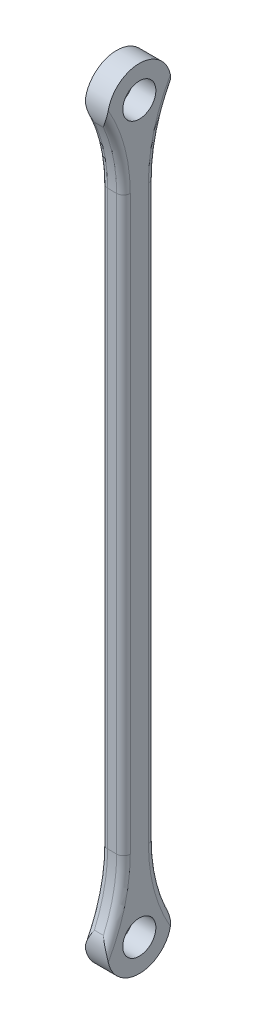
ISO-10303-21;
HEADER;
FILE_DESCRIPTION(('STEP AP214'),'2;1');
FILE_NAME('part.step','',(''),(''),'','','');
FILE_SCHEMA(('AUTOMOTIVE_DESIGN { 1 0 10303 214 1 1 1 1 }'));
ENDSEC;
DATA;
#1=APPLICATION_CONTEXT('core data for automotive mechanical design processes');
#2=APPLICATION_PROTOCOL_DEFINITION('international standard','automotive_design',2000,#1);
#3=PRODUCT_CONTEXT('',#1,'mechanical');
#4=PRODUCT('Part','Part','',(#3));
#5=PRODUCT_RELATED_PRODUCT_CATEGORY('part','',(#4));
#6=PRODUCT_DEFINITION_FORMATION('','',#4);
#7=PRODUCT_DEFINITION_CONTEXT('part definition',#1,'design');
#8=PRODUCT_DEFINITION('design','',#6,#7);
#9=PRODUCT_DEFINITION_SHAPE('','',#8);
#10=(LENGTH_UNIT() NAMED_UNIT(*) SI_UNIT(.MILLI.,.METRE.));
#11=(NAMED_UNIT(*) PLANE_ANGLE_UNIT() SI_UNIT($,.RADIAN.));
#12=(NAMED_UNIT(*) SI_UNIT($,.STERADIAN.) SOLID_ANGLE_UNIT());
#13=UNCERTAINTY_MEASURE_WITH_UNIT(LENGTH_MEASURE(1.E-05),#10,'distance_accuracy_value','');
#14=(GEOMETRIC_REPRESENTATION_CONTEXT(3) GLOBAL_UNCERTAINTY_ASSIGNED_CONTEXT((#13)) GLOBAL_UNIT_ASSIGNED_CONTEXT((#10,
#11,#12)) REPRESENTATION_CONTEXT('',''));
#15=CARTESIAN_POINT('',(0.,0.,0.));
#16=DIRECTION('',(0.,0.,1.));
#17=DIRECTION('',(1.,0.,0.));
#18=AXIS2_PLACEMENT_3D('',#15,#16,#17);
#19=CARTESIAN_POINT('',(-28.669607513477,31.0636668384129,65.25));
#20=DIRECTION('',(1.,0.,0.));
#21=DIRECTION('',(0.,0.,-1.));
#22=AXIS2_PLACEMENT_3D('',#19,#20,#21);
#23=CYLINDRICAL_SURFACE('',#22,7.);
#24=DIRECTION('',(1.,0.,0.));
#25=VECTOR('',#24,1.);
#26=CARTESIAN_POINT('',(-28.669607513477,33.8494969166002,71.6717716228053));
#27=LINE('',#26,#25);
#28=CARTESIAN_POINT('',(-27.169607513477,33.8494969166002,71.6717716228053));
#29=VERTEX_POINT('',#28);
#30=CARTESIAN_POINT('',(-25.169607513477,33.8494969166002,71.6717716228053));
#31=VERTEX_POINT('',#30);
#32=EDGE_CURVE('E318',#29,#31,#27,.T.);
#33=ORIENTED_EDGE('',*,*,#32,.F.);
#34=CARTESIAN_POINT('',(-28.669607513477,29.6404947748071,72.1038004988015));
#35=CARTESIAN_POINT('',(-28.6695704013757,29.7400734051743,72.1244921041939));
#36=CARTESIAN_POINT('',(-28.6650757040334,29.8399988829421,72.1429638390914));
#37=CARTESIAN_POINT('',(-28.6484590172141,30.0397461883465,72.1754422096041));
#38=CARTESIAN_POINT('',(-28.6363526543562,30.1395678096574,72.1894579048446));
#39=CARTESIAN_POINT('',(-28.6059186628535,30.3378836777137,72.2129839358825));
#40=CARTESIAN_POINT('',(-28.5876442962595,30.4363820228194,72.2225312268951));
#41=CARTESIAN_POINT('',(-28.5458275867531,30.632626970941,72.2374096350373));
#42=CARTESIAN_POINT('',(-28.5222816222107,30.730373009134,72.2427378421505));
#43=CARTESIAN_POINT('',(-28.4535825241448,30.9897693384142,72.2514900006123));
#44=CARTESIAN_POINT('',(-28.4044995805025,31.150511328527,72.2512670807801));
#45=CARTESIAN_POINT('',(-28.297203016173,31.4685213495004,72.2400956876657));
#46=CARTESIAN_POINT('',(-28.2389851473359,31.6257877250291,72.2291422117041));
#47=CARTESIAN_POINT('',(-28.1154897965387,31.937347335544,72.1970372703421));
#48=CARTESIAN_POINT('',(-28.0501785367024,32.0916218185841,72.1758351896584));
#49=CARTESIAN_POINT('',(-27.9146644049547,32.3962459172582,72.1237256351956));
#50=CARTESIAN_POINT('',(-27.8444629167562,32.5465966267232,72.0928208982182));
#51=CARTESIAN_POINT('',(-27.6770079861382,32.8923742076471,72.0099582888477));
#52=CARTESIAN_POINT('',(-27.5784661735063,33.086320347656,71.954418620875));
#53=CARTESIAN_POINT('',(-27.3787809153891,33.4669816952166,71.8275542861129));
#54=CARTESIAN_POINT('',(-27.277644068507,33.6537127016992,71.7562667094559));
#55=CARTESIAN_POINT('',(-27.1742139794816,33.8411541682721,71.6753859587341));
#56=CARTESIAN_POINT('',(-27.1719107354911,33.845326441299,71.6735808109836));
#57=CARTESIAN_POINT('',(-27.169607513477,33.8494969166002,71.6717716228053));
#58=B_SPLINE_CURVE_WITH_KNOTS('',3,(#34,#35,#36,#37,#38,#39,#40,#41,#42,#43,#44,#45,#46,#47,#48,
#49,#50,#51,#52,#53,#54,#55,#56,#57),.UNSPECIFIED.,.F.,.F.,(4,2,2,2,2,2,2,2,2,2,2,4),(0.,
0.304835484361001,0.609047181067465,0.910696435437838,1.21255356467109,1.71595938656179,
2.2196000124009,2.72575380788479,3.23176496202873,3.90459775131097,4.57586243902976,
4.59115105919159),.UNSPECIFIED.);
#59=CARTESIAN_POINT('',(-28.669607513477,29.6404947748071,72.1038004988015));
#60=VERTEX_POINT('',#59);
#61=EDGE_CURVE('E242',#29,#60,#58,.F.);
#62=ORIENTED_EDGE('',*,*,#61,.T.);
#63=CARTESIAN_POINT('',(-28.669607513477,31.0636668384129,65.25));
#64=DIRECTION('',(-1.,0.,0.));
#65=DIRECTION('',(0.,0.,1.));
#66=AXIS2_PLACEMENT_3D('',#63,#64,#65);
#67=CIRCLE('',#66,7.);
#68=CARTESIAN_POINT('',(-28.669607513477,29.6404947748071,58.3961995011985));
#69=VERTEX_POINT('',#68);
#70=EDGE_CURVE('E170',#69,#60,#67,.T.);
#71=ORIENTED_EDGE('',*,*,#70,.F.);
#72=CARTESIAN_POINT('',(-28.669607513477,29.6404947748071,58.3961995011985));
#73=CARTESIAN_POINT('',(-28.6695704013757,29.7400734051742,58.3755078958062));
#74=CARTESIAN_POINT('',(-28.6650757040334,29.839998882942,58.3570361609086));
#75=CARTESIAN_POINT('',(-28.6484590172142,30.0397461883463,58.324557790396));
#76=CARTESIAN_POINT('',(-28.6363526543562,30.1395678096571,58.3105420951554));
#77=CARTESIAN_POINT('',(-28.6059186628536,30.3378836777134,58.2870160641175));
#78=CARTESIAN_POINT('',(-28.5876442962596,30.4363820228192,58.2774687731049));
#79=CARTESIAN_POINT('',(-28.5458275867532,30.6326269709409,58.2625903649628));
#80=CARTESIAN_POINT('',(-28.5222816222107,30.730373009134,58.2572621578495));
#81=CARTESIAN_POINT('',(-28.4535825241448,30.9897693384143,58.2485099993877));
#82=CARTESIAN_POINT('',(-28.4044995805024,31.1505113285271,58.2487329192199));
#83=CARTESIAN_POINT('',(-28.297203016173,31.4685213495006,58.2599043123343));
#84=CARTESIAN_POINT('',(-28.2389851473358,31.6257877250293,58.2708577882959));
#85=CARTESIAN_POINT('',(-28.1154897965387,31.9373473355442,58.302962729658));
#86=CARTESIAN_POINT('',(-28.0501785367024,32.0916218185843,58.3241648103416));
#87=CARTESIAN_POINT('',(-27.9146644049546,32.3962459172582,58.3762743648044));
#88=CARTESIAN_POINT('',(-27.8444629167559,32.5465966267232,58.4071791017818));
#89=CARTESIAN_POINT('',(-27.6770079861386,32.8923742076473,58.4900417111524));
#90=CARTESIAN_POINT('',(-27.578466173508,33.0863203476568,58.5455813791254));
#91=CARTESIAN_POINT('',(-27.3787809153875,33.4669816952159,58.6724457138868));
#92=CARTESIAN_POINT('',(-27.2776440685008,33.6537127016964,58.7437332905428));
#93=CARTESIAN_POINT('',(-27.1742139794813,33.841154168272,58.8246140412659));
#94=CARTESIAN_POINT('',(-27.171910735491,33.845326441299,58.8264191890164));
#95=CARTESIAN_POINT('',(-27.169607513477,33.8494969166002,58.8282283771947));
#96=B_SPLINE_CURVE_WITH_KNOTS('',3,(#72,#73,#74,#75,#76,#77,#78,#79,#80,#81,#82,#83,#84,#85,#86,
#87,#88,#89,#90,#91,#92,#93,#94,#95),.UNSPECIFIED.,.F.,.F.,(4,2,2,2,2,2,2,2,2,2,2,4),(0.,
0.304835484360824,0.609047181067108,0.910696435437656,1.21255356467109,1.71595938656195,
2.21960001240117,2.72575380788493,3.23176496202877,3.90459775131097,4.57586243902978,
4.5911510591916),.UNSPECIFIED.);
#97=CARTESIAN_POINT('',(-27.169607513477,33.8494969166002,58.8282283771947));
#98=VERTEX_POINT('',#97);
#99=EDGE_CURVE('E159',#69,#98,#96,.T.);
#100=ORIENTED_EDGE('',*,*,#99,.T.);
#101=DIRECTION('',(1.,0.,0.));
#102=VECTOR('',#101,1.);
#103=CARTESIAN_POINT('',(-28.669607513477,33.8494969166002,58.8282283771947));
#104=LINE('',#103,#102);
#105=CARTESIAN_POINT('',(-25.169607513477,33.8494969166002,58.8282283771947));
#106=VERTEX_POINT('',#105);
#107=EDGE_CURVE('E155',#98,#106,#104,.T.);
#108=ORIENTED_EDGE('',*,*,#107,.T.);
#109=CARTESIAN_POINT('',(-23.669607513477,29.6404947748071,58.3961995011985));
#110=CARTESIAN_POINT('',(-23.6696446255784,29.7400734051742,58.3755078958062));
#111=CARTESIAN_POINT('',(-23.6741393229206,29.839998882942,58.3570361609086));
#112=CARTESIAN_POINT('',(-23.6907560097398,30.0397461883463,58.324557790396));
#113=CARTESIAN_POINT('',(-23.7028623725978,30.1395678096571,58.3105420951554));
#114=CARTESIAN_POINT('',(-23.7332963641004,30.3378836777134,58.2870160641175));
#115=CARTESIAN_POINT('',(-23.7515707306945,30.4363820228192,58.2774687731049));
#116=CARTESIAN_POINT('',(-23.7933874402009,30.6326269709409,58.2625903649628));
#117=CARTESIAN_POINT('',(-23.8169334047433,30.730373009134,58.2572621578495));
#118=CARTESIAN_POINT('',(-23.8856325028092,30.9897693384143,58.2485099993877));
#119=CARTESIAN_POINT('',(-23.9347154464516,31.1505113285271,58.2487329192199));
#120=CARTESIAN_POINT('',(-24.0420120107811,31.4685213495006,58.2599043123343));
#121=CARTESIAN_POINT('',(-24.1002298796182,31.6257877250293,58.2708577882959));
#122=CARTESIAN_POINT('',(-24.2237252304153,31.9373473355442,58.302962729658));
#123=CARTESIAN_POINT('',(-24.2890364902516,32.0916218185843,58.3241648103416));
#124=CARTESIAN_POINT('',(-24.4245506219995,32.3962459172582,58.3762743648044));
#125=CARTESIAN_POINT('',(-24.4947521101981,32.5465966267232,58.4071791017818));
#126=CARTESIAN_POINT('',(-24.6622070408154,32.8923742076473,58.4900417111524));
#127=CARTESIAN_POINT('',(-24.760748853446,33.0863203476568,58.5455813791254));
#128=CARTESIAN_POINT('',(-24.9604341115665,33.4669816952159,58.6724457138868));
#129=CARTESIAN_POINT('',(-25.0615709584532,33.6537127016964,58.7437332905428));
#130=CARTESIAN_POINT('',(-25.1650010474727,33.841154168272,58.8246140412659));
#131=CARTESIAN_POINT('',(-25.167304291463,33.845326441299,58.8264191890164));
#132=CARTESIAN_POINT('',(-25.169607513477,33.8494969166002,58.8282283771947));
#133=B_SPLINE_CURVE_WITH_KNOTS('',3,(#109,#110,#111,#112,#113,#114,#115,#116,#117,#118,#119,
#120,#121,#122,#123,#124,#125,#126,#127,#128,#129,#130,#131,#132),.UNSPECIFIED.,.F.,.F.,(4,2,2,
2,2,2,2,2,2,2,2,4),(0.,0.304835484360824,0.609047181067108,0.910696435437656,1.21255356467109,
1.71595938656195,2.21960001240117,2.72575380788493,3.23176496202877,3.90459775131097,
4.57586243902978,4.5911510591916),.UNSPECIFIED.);
#134=CARTESIAN_POINT('',(-23.669607513477,29.6404947748071,58.3961995011985));
#135=VERTEX_POINT('',#134);
#136=EDGE_CURVE('E149',#106,#135,#133,.F.);
#137=ORIENTED_EDGE('',*,*,#136,.T.);
#138=CARTESIAN_POINT('',(-23.669607513477,31.0636668384129,65.25));
#139=DIRECTION('',(-1.,0.,0.));
#140=DIRECTION('',(0.,0.,1.));
#141=AXIS2_PLACEMENT_3D('',#138,#139,#140);
#142=CIRCLE('',#141,7.);
#143=CARTESIAN_POINT('',(-23.669607513477,29.6404947748071,72.1038004988015));
#144=VERTEX_POINT('',#143);
#145=EDGE_CURVE('E152',#135,#144,#142,.T.);
#146=ORIENTED_EDGE('',*,*,#145,.T.);
#147=CARTESIAN_POINT('',(-23.669607513477,29.6404947748071,72.1038004988015));
#148=CARTESIAN_POINT('',(-23.6696446255783,29.7400734051743,72.1244921041939));
#149=CARTESIAN_POINT('',(-23.6741393229206,29.8399988829421,72.1429638390914));
#150=CARTESIAN_POINT('',(-23.6907560097399,30.0397461883465,72.1754422096041));
#151=CARTESIAN_POINT('',(-23.7028623725978,30.1395678096574,72.1894579048446));
#152=CARTESIAN_POINT('',(-23.7332963641005,30.3378836777137,72.2129839358825));
#153=CARTESIAN_POINT('',(-23.7515707306945,30.4363820228194,72.2225312268951));
#154=CARTESIAN_POINT('',(-23.7933874402009,30.632626970941,72.2374096350373));
#155=CARTESIAN_POINT('',(-23.8169334047433,30.730373009134,72.2427378421505));
#156=CARTESIAN_POINT('',(-23.8856325028092,30.9897693384142,72.2514900006123));
#157=CARTESIAN_POINT('',(-23.9347154464516,31.150511328527,72.2512670807801));
#158=CARTESIAN_POINT('',(-24.042012010781,31.4685213495004,72.2400956876657));
#159=CARTESIAN_POINT('',(-24.1002298796181,31.6257877250291,72.2291422117041));
#160=CARTESIAN_POINT('',(-24.2237252304153,31.937347335544,72.1970372703421));
#161=CARTESIAN_POINT('',(-24.2890364902517,32.0916218185841,72.1758351896584));
#162=CARTESIAN_POINT('',(-24.4245506219993,32.3962459172582,72.1237256351956));
#163=CARTESIAN_POINT('',(-24.4947521101978,32.5465966267232,72.0928208982182));
#164=CARTESIAN_POINT('',(-24.6622070408158,32.8923742076471,72.0099582888477));
#165=CARTESIAN_POINT('',(-24.7607488534477,33.086320347656,71.954418620875));
#166=CARTESIAN_POINT('',(-24.9604341115649,33.4669816952166,71.8275542861129));
#167=CARTESIAN_POINT('',(-25.061570958447,33.6537127016992,71.7562667094559));
#168=CARTESIAN_POINT('',(-25.1650010474724,33.8411541682721,71.6753859587341));
#169=CARTESIAN_POINT('',(-25.1673042914629,33.845326441299,71.6735808109836));
#170=CARTESIAN_POINT('',(-25.169607513477,33.8494969166002,71.6717716228053));
#171=B_SPLINE_CURVE_WITH_KNOTS('',3,(#147,#148,#149,#150,#151,#152,#153,#154,#155,#156,#157,
#158,#159,#160,#161,#162,#163,#164,#165,#166,#167,#168,#169,#170),.UNSPECIFIED.,.F.,.F.,(4,2,2,
2,2,2,2,2,2,2,2,4),(0.,0.304835484361001,0.609047181067465,0.910696435437838,1.21255356467109,
1.71595938656179,2.2196000124009,2.7257538078848,3.23176496202873,3.90459775131098,
4.57586243902976,4.59115105919159),.UNSPECIFIED.);
#172=EDGE_CURVE('E160',#144,#31,#171,.T.);
#173=ORIENTED_EDGE('',*,*,#172,.T.);
#174=EDGE_LOOP('',(#33,#62,#71,#100,#108,#137,#146,#173));
#175=FACE_BOUND('',#174,.T.);
#176=ADVANCED_FACE('F32',(#175),#23,.T.);
#177=CARTESIAN_POINT('',(-28.669607513477,31.0636668384129,65.25));
#178=DIRECTION('',(-1.,0.,0.));
#179=DIRECTION('',(0.,0.,1.));
#180=AXIS2_PLACEMENT_3D('',#177,#178,#179);
#181=PLANE('',#180);
#182=CARTESIAN_POINT('',(-28.669607513477,31.0636668384129,65.25));
#183=DIRECTION('',(-1.,0.,0.));
#184=DIRECTION('',(0.,0.,1.));
#185=AXIS2_PLACEMENT_3D('',#182,#183,#184);
#186=CIRCLE('',#185,3.65);
#187=CARTESIAN_POINT('',(-28.669607513477,31.0636668384129,68.9));
#188=VERTEX_POINT('',#187);
#189=EDGE_CURVE('E384',#188,#188,#186,.T.);
#190=ORIENTED_EDGE('',*,*,#189,.F.);
#191=EDGE_LOOP('',(#190));
#192=FACE_BOUND('',#191,.T.);
#193=CARTESIAN_POINT('',(-28.669607513477,191.063666838413,65.25));
#194=DIRECTION('',(-1.,0.,0.));
#195=DIRECTION('',(0.,0.,1.));
#196=AXIS2_PLACEMENT_3D('',#193,#194,#195);
#197=CIRCLE('',#196,3.65);
#198=CARTESIAN_POINT('',(-28.669607513477,191.063666838413,68.9));
#199=VERTEX_POINT('',#198);
#200=EDGE_CURVE('E381',#199,#199,#197,.T.);
#201=ORIENTED_EDGE('',*,*,#200,.F.);
#202=EDGE_LOOP('',(#201));
#203=FACE_BOUND('',#202,.T.);
#204=ORIENTED_EDGE('',*,*,#70,.T.);
#205=CARTESIAN_POINT('',(-28.669607513477,47.9262174468066,104.120801860091));
#206=DIRECTION('',(-1.,0.,0.));
#207=DIRECTION('',(0.,0.,1.));
#208=AXIS2_PLACEMENT_3D('',#205,#206,#207);
#209=CIRCLE('',#208,36.8708018600912);
#210=CARTESIAN_POINT('',(-28.669607513477,47.9262174468066,67.25));
#211=VERTEX_POINT('',#210);
#212=EDGE_CURVE('E201',#60,#211,#209,.F.);
#213=ORIENTED_EDGE('',*,*,#212,.T.);
#214=DIRECTION('',(0.,-1.,0.));
#215=VECTOR('',#214,1.);
#216=CARTESIAN_POINT('',(-28.669607513477,31.0636668384129,67.25));
#217=LINE('',#216,#215);
#218=CARTESIAN_POINT('',(-28.669607513477,174.201116230019,67.25));
#219=VERTEX_POINT('',#218);
#220=EDGE_CURVE('E199',#211,#219,#217,.F.);
#221=ORIENTED_EDGE('',*,*,#220,.T.);
#222=CARTESIAN_POINT('',(-28.669607513477,174.201116230019,104.120801860091));
#223=DIRECTION('',(-1.,0.,0.));
#224=DIRECTION('',(0.,0.,1.));
#225=AXIS2_PLACEMENT_3D('',#222,#223,#224);
#226=CIRCLE('',#225,36.8708018600912);
#227=CARTESIAN_POINT('',(-28.669607513477,192.486838902019,72.1038004988015));
#228=VERTEX_POINT('',#227);
#229=EDGE_CURVE('E197',#219,#228,#226,.F.);
#230=ORIENTED_EDGE('',*,*,#229,.T.);
#231=CARTESIAN_POINT('',(-28.669607513477,191.063666838413,65.25));
#232=DIRECTION('',(1.,0.,0.));
#233=DIRECTION('',(0.,0.,-1.));
#234=AXIS2_PLACEMENT_3D('',#231,#232,#233);
#235=CIRCLE('',#234,7.00000000000002);
#236=CARTESIAN_POINT('',(-28.669607513477,192.486838902019,58.3961995011985));
#237=VERTEX_POINT('',#236);
#238=EDGE_CURVE('E353',#237,#228,#235,.T.);
#239=ORIENTED_EDGE('',*,*,#238,.F.);
#240=CARTESIAN_POINT('',(-28.669607513477,174.201116230019,26.3791981399088));
#241=DIRECTION('',(-1.,0.,0.));
#242=DIRECTION('',(0.,0.,1.));
#243=AXIS2_PLACEMENT_3D('',#240,#241,#242);
#244=CIRCLE('',#243,36.8708018600912);
#245=CARTESIAN_POINT('',(-28.669607513477,174.201116230019,63.25));
#246=VERTEX_POINT('',#245);
#247=EDGE_CURVE('E191',#237,#246,#244,.F.);
#248=ORIENTED_EDGE('',*,*,#247,.T.);
#249=DIRECTION('',(0.,1.,0.));
#250=VECTOR('',#249,1.);
#251=CARTESIAN_POINT('',(-28.669607513477,31.0636668384129,63.25));
#252=LINE('',#251,#250);
#253=CARTESIAN_POINT('',(-28.669607513477,47.9262174468066,63.25));
#254=VERTEX_POINT('',#253);
#255=EDGE_CURVE('E193',#246,#254,#252,.F.);
#256=ORIENTED_EDGE('',*,*,#255,.T.);
#257=CARTESIAN_POINT('',(-28.669607513477,47.9262174468066,26.3791981399088));
#258=DIRECTION('',(-1.,0.,0.));
#259=DIRECTION('',(0.,0.,1.));
#260=AXIS2_PLACEMENT_3D('',#257,#258,#259);
#261=CIRCLE('',#260,36.8708018600912);
#262=EDGE_CURVE('E195',#254,#69,#261,.F.);
#263=ORIENTED_EDGE('',*,*,#262,.T.);
#264=EDGE_LOOP('',(#204,#213,#221,#230,#239,#248,#256,#263));
#265=FACE_BOUND('',#264,.T.);
#266=ADVANCED_FACE('F230',(#192,#203,#265),#181,.T.);
#267=CARTESIAN_POINT('',(-23.669607513477,31.0636668384129,65.25));
#268=DIRECTION('',(-1.,0.,0.));
#269=DIRECTION('',(0.,0.,1.));
#270=AXIS2_PLACEMENT_3D('',#267,#268,#269);
#271=PLANE('',#270);
#272=CARTESIAN_POINT('',(-23.669607513477,31.0636668384129,65.25));
#273=DIRECTION('',(-1.,0.,0.));
#274=DIRECTION('',(0.,0.,1.));
#275=AXIS2_PLACEMENT_3D('',#272,#273,#274);
#276=CIRCLE('',#275,3.65);
#277=CARTESIAN_POINT('',(-23.669607513477,31.0636668384129,68.9));
#278=VERTEX_POINT('',#277);
#279=EDGE_CURVE('E382',#278,#278,#276,.T.);
#280=ORIENTED_EDGE('',*,*,#279,.T.);
#281=EDGE_LOOP('',(#280));
#282=FACE_BOUND('',#281,.T.);
#283=CARTESIAN_POINT('',(-23.669607513477,191.063666838413,65.25));
#284=DIRECTION('',(-1.,0.,0.));
#285=DIRECTION('',(0.,0.,1.));
#286=AXIS2_PLACEMENT_3D('',#283,#284,#285);
#287=CIRCLE('',#286,3.65);
#288=CARTESIAN_POINT('',(-23.669607513477,191.063666838413,68.9));
#289=VERTEX_POINT('',#288);
#290=EDGE_CURVE('E354',#289,#289,#287,.T.);
#291=ORIENTED_EDGE('',*,*,#290,.T.);
#292=EDGE_LOOP('',(#291));
#293=FACE_BOUND('',#292,.T.);
#294=DIRECTION('',(0.,-1.,0.));
#295=VECTOR('',#294,1.);
#296=CARTESIAN_POINT('',(-23.669607513477,47.9262174468066,67.25));
#297=LINE('',#296,#295);
#298=CARTESIAN_POINT('',(-23.669607513477,174.201116230019,67.25));
#299=VERTEX_POINT('',#298);
#300=CARTESIAN_POINT('',(-23.669607513477,47.9262174468066,67.25));
#301=VERTEX_POINT('',#300);
#302=EDGE_CURVE('E178',#299,#301,#297,.T.);
#303=ORIENTED_EDGE('',*,*,#302,.T.);
#304=CARTESIAN_POINT('',(-23.669607513477,47.9262174468066,104.120801860091));
#305=DIRECTION('',(-1.,0.,0.));
#306=DIRECTION('',(0.,0.,1.));
#307=AXIS2_PLACEMENT_3D('',#304,#305,#306);
#308=CIRCLE('',#307,36.8708018600912);
#309=EDGE_CURVE('E169',#301,#144,#308,.T.);
#310=ORIENTED_EDGE('',*,*,#309,.T.);
#311=ORIENTED_EDGE('',*,*,#145,.F.);
#312=CARTESIAN_POINT('',(-23.669607513477,47.9262174468066,26.3791981399088));
#313=DIRECTION('',(-1.,0.,0.));
#314=DIRECTION('',(0.,0.,1.));
#315=AXIS2_PLACEMENT_3D('',#312,#313,#314);
#316=CIRCLE('',#315,36.8708018600912);
#317=CARTESIAN_POINT('',(-23.669607513477,47.9262174468066,63.25));
#318=VERTEX_POINT('',#317);
#319=EDGE_CURVE('E166',#135,#318,#316,.T.);
#320=ORIENTED_EDGE('',*,*,#319,.T.);
#321=DIRECTION('',(0.,1.,0.));
#322=VECTOR('',#321,1.);
#323=CARTESIAN_POINT('',(-23.669607513477,174.201116230019,63.25));
#324=LINE('',#323,#322);
#325=CARTESIAN_POINT('',(-23.669607513477,174.201116230019,63.25));
#326=VERTEX_POINT('',#325);
#327=EDGE_CURVE('E176',#318,#326,#324,.T.);
#328=ORIENTED_EDGE('',*,*,#327,.T.);
#329=CARTESIAN_POINT('',(-23.669607513477,174.201116230019,26.3791981399088));
#330=DIRECTION('',(-1.,0.,0.));
#331=DIRECTION('',(0.,0.,1.));
#332=AXIS2_PLACEMENT_3D('',#329,#330,#331);
#333=CIRCLE('',#332,36.8708018600912);
#334=CARTESIAN_POINT('',(-23.669607513477,192.486838902019,58.3961995011985));
#335=VERTEX_POINT('',#334);
#336=EDGE_CURVE('E180',#326,#335,#333,.T.);
#337=ORIENTED_EDGE('',*,*,#336,.T.);
#338=CARTESIAN_POINT('',(-23.669607513477,191.063666838413,65.25));
#339=DIRECTION('',(1.,0.,0.));
#340=DIRECTION('',(0.,0.,-1.));
#341=AXIS2_PLACEMENT_3D('',#338,#339,#340);
#342=CIRCLE('',#341,7.00000000000002);
#343=CARTESIAN_POINT('',(-23.669607513477,192.486838902019,72.1038004988015));
#344=VERTEX_POINT('',#343);
#345=EDGE_CURVE('E349',#335,#344,#342,.T.);
#346=ORIENTED_EDGE('',*,*,#345,.T.);
#347=CARTESIAN_POINT('',(-23.669607513477,174.201116230019,104.120801860091));
#348=DIRECTION('',(-1.,0.,0.));
#349=DIRECTION('',(0.,0.,1.));
#350=AXIS2_PLACEMENT_3D('',#347,#348,#349);
#351=CIRCLE('',#350,36.8708018600912);
#352=EDGE_CURVE('E175',#344,#299,#351,.T.);
#353=ORIENTED_EDGE('',*,*,#352,.T.);
#354=EDGE_LOOP('',(#303,#310,#311,#320,#328,#337,#346,#353));
#355=FACE_BOUND('',#354,.T.);
#356=ADVANCED_FACE('F164',(#282,#293,#355),#271,.F.);
#357=CARTESIAN_POINT('',(-28.669607513477,174.201116230019,26.3791981399088));
#358=DIRECTION('',(1.,0.,0.));
#359=DIRECTION('',(0.,0.,-1.));
#360=AXIS2_PLACEMENT_3D('',#357,#358,#359);
#361=CYLINDRICAL_SURFACE('',#360,35.3708018600912);
#362=DIRECTION('',(1.,0.,0.));
#363=VECTOR('',#362,1.);
#364=CARTESIAN_POINT('',(-28.669607513477,188.277836760226,58.8282283771947));
#365=LINE('',#364,#363);
#366=CARTESIAN_POINT('',(-27.169607513477,188.277836760226,58.8282283771947));
#367=VERTEX_POINT('',#366);
#368=CARTESIAN_POINT('',(-25.169607513477,188.277836760226,58.8282283771947));
#369=VERTEX_POINT('',#368);
#370=EDGE_CURVE('E358',#367,#369,#365,.T.);
#371=ORIENTED_EDGE('',*,*,#370,.T.);
#372=CARTESIAN_POINT('',(-25.169607513477,174.201116230019,26.3791981399088));
#373=DIRECTION('',(-1.,0.,0.));
#374=DIRECTION('',(0.,0.,1.));
#375=AXIS2_PLACEMENT_3D('',#372,#373,#374);
#376=CIRCLE('',#375,35.3708018600912);
#377=CARTESIAN_POINT('',(-25.169607513477,174.201116230019,61.75));
#378=VERTEX_POINT('',#377);
#379=EDGE_CURVE('E11',#369,#378,#376,.F.);
#380=ORIENTED_EDGE('',*,*,#379,.T.);
#381=DIRECTION('',(1.,0.,0.));
#382=VECTOR('',#381,1.);
#383=CARTESIAN_POINT('',(-28.669607513477,174.201116230019,61.75));
#384=LINE('',#383,#382);
#385=CARTESIAN_POINT('',(-27.169607513477,174.201116230019,61.75));
#386=VERTEX_POINT('',#385);
#387=EDGE_CURVE('E171',#386,#378,#384,.T.);
#388=ORIENTED_EDGE('',*,*,#387,.F.);
#389=CARTESIAN_POINT('',(-27.169607513477,174.201116230019,26.3791981399088));
#390=DIRECTION('',(-1.,0.,0.));
#391=DIRECTION('',(0.,0.,1.));
#392=AXIS2_PLACEMENT_3D('',#389,#390,#391);
#393=CIRCLE('',#392,35.3708018600912);
#394=EDGE_CURVE('E42',#386,#367,#393,.T.);
#395=ORIENTED_EDGE('',*,*,#394,.T.);
#396=EDGE_LOOP('',(#371,#380,#388,#395));
#397=FACE_BOUND('',#396,.T.);
#398=ADVANCED_FACE('F295',(#397),#361,.F.);
#399=CARTESIAN_POINT('',(-28.669607513477,174.201116230019,61.75));
#400=DIRECTION('',(0.,0.,-1.));
#401=DIRECTION('',(-1.,0.,0.));
#402=AXIS2_PLACEMENT_3D('',#399,#400,#401);
#403=PLANE('',#402);
#404=DIRECTION('',(1.,0.,0.));
#405=VECTOR('',#404,1.);
#406=CARTESIAN_POINT('',(-28.669607513477,47.9262174468066,61.75));
#407=LINE('',#406,#405);
#408=CARTESIAN_POINT('',(-27.169607513477,47.9262174468066,61.75));
#409=VERTEX_POINT('',#408);
#410=CARTESIAN_POINT('',(-25.169607513477,47.9262174468066,61.75));
#411=VERTEX_POINT('',#410);
#412=EDGE_CURVE('E363',#409,#411,#407,.T.);
#413=ORIENTED_EDGE('',*,*,#412,.F.);
#414=DIRECTION('',(0.,1.,0.));
#415=VECTOR('',#414,1.);
#416=CARTESIAN_POINT('',(-27.169607513477,174.201116230019,61.75));
#417=LINE('',#416,#415);
#418=EDGE_CURVE('E205',#409,#386,#417,.T.);
#419=ORIENTED_EDGE('',*,*,#418,.T.);
#420=ORIENTED_EDGE('',*,*,#387,.T.);
#421=DIRECTION('',(0.,1.,0.));
#422=VECTOR('',#421,1.);
#423=CARTESIAN_POINT('',(-25.169607513477,47.9262174468066,61.75));
#424=LINE('',#423,#422);
#425=EDGE_CURVE('E203',#378,#411,#424,.F.);
#426=ORIENTED_EDGE('',*,*,#425,.T.);
#427=EDGE_LOOP('',(#413,#419,#420,#426));
#428=FACE_BOUND('',#427,.T.);
#429=ADVANCED_FACE('F361',(#428),#403,.T.);
#430=CARTESIAN_POINT('',(-28.669607513477,47.9262174468066,26.3791981399088));
#431=DIRECTION('',(1.,0.,0.));
#432=DIRECTION('',(0.,0.,-1.));
#433=AXIS2_PLACEMENT_3D('',#430,#431,#432);
#434=CYLINDRICAL_SURFACE('',#433,35.3708018600912);
#435=ORIENTED_EDGE('',*,*,#107,.F.);
#436=CARTESIAN_POINT('',(-27.169607513477,47.9262174468066,26.3791981399088));
#437=DIRECTION('',(-1.,0.,0.));
#438=DIRECTION('',(0.,0.,1.));
#439=AXIS2_PLACEMENT_3D('',#436,#437,#438);
#440=CIRCLE('',#439,35.3708018600912);
#441=EDGE_CURVE('E309',#98,#409,#440,.T.);
#442=ORIENTED_EDGE('',*,*,#441,.T.);
#443=ORIENTED_EDGE('',*,*,#412,.T.);
#444=CARTESIAN_POINT('',(-25.169607513477,47.9262174468066,26.3791981399088));
#445=DIRECTION('',(-1.,0.,0.));
#446=DIRECTION('',(0.,0.,1.));
#447=AXIS2_PLACEMENT_3D('',#444,#445,#446);
#448=CIRCLE('',#447,35.3708018600912);
#449=EDGE_CURVE('E310',#411,#106,#448,.F.);
#450=ORIENTED_EDGE('',*,*,#449,.T.);
#451=EDGE_LOOP('',(#435,#442,#443,#450));
#452=FACE_BOUND('',#451,.T.);
#453=ADVANCED_FACE('F446',(#452),#434,.F.);
#454=CARTESIAN_POINT('',(-28.669607513477,47.9262174468066,104.120801860091));
#455=DIRECTION('',(1.,0.,0.));
#456=DIRECTION('',(0.,0.,-1.));
#457=AXIS2_PLACEMENT_3D('',#454,#455,#456);
#458=CYLINDRICAL_SURFACE('',#457,35.3708018600912);
#459=DIRECTION('',(1.,0.,0.));
#460=VECTOR('',#459,1.);
#461=CARTESIAN_POINT('',(-28.669607513477,47.9262174468066,68.75));
#462=LINE('',#461,#460);
#463=CARTESIAN_POINT('',(-27.169607513477,47.9262174468066,68.75));
#464=VERTEX_POINT('',#463);
#465=CARTESIAN_POINT('',(-25.169607513477,47.9262174468066,68.75));
#466=VERTEX_POINT('',#465);
#467=EDGE_CURVE('E370',#464,#466,#462,.T.);
#468=ORIENTED_EDGE('',*,*,#467,.F.);
#469=CARTESIAN_POINT('',(-27.169607513477,47.9262174468066,104.120801860091));
#470=DIRECTION('',(-1.,0.,0.));
#471=DIRECTION('',(0.,0.,1.));
#472=AXIS2_PLACEMENT_3D('',#469,#470,#471);
#473=CIRCLE('',#472,35.3708018600912);
#474=EDGE_CURVE('E210',#464,#29,#473,.T.);
#475=ORIENTED_EDGE('',*,*,#474,.T.);
#476=ORIENTED_EDGE('',*,*,#32,.T.);
#477=CARTESIAN_POINT('',(-25.169607513477,47.9262174468066,104.120801860091));
#478=DIRECTION('',(-1.,0.,0.));
#479=DIRECTION('',(0.,0.,1.));
#480=AXIS2_PLACEMENT_3D('',#477,#478,#479);
#481=CIRCLE('',#480,35.3708018600912);
#482=EDGE_CURVE('E208',#31,#466,#481,.F.);
#483=ORIENTED_EDGE('',*,*,#482,.T.);
#484=EDGE_LOOP('',(#468,#475,#476,#483));
#485=FACE_BOUND('',#484,.T.);
#486=ADVANCED_FACE('F448',(#485),#458,.F.);
#487=CARTESIAN_POINT('',(-28.669607513477,174.201116230019,68.75));
#488=DIRECTION('',(0.,0.,1.));
#489=DIRECTION('',(1.,0.,0.));
#490=AXIS2_PLACEMENT_3D('',#487,#488,#489);
#491=PLANE('',#490);
#492=ORIENTED_EDGE('',*,*,#467,.T.);
#493=DIRECTION('',(0.,-1.,0.));
#494=VECTOR('',#493,1.);
#495=CARTESIAN_POINT('',(-25.169607513477,174.201116230019,68.75));
#496=LINE('',#495,#494);
#497=CARTESIAN_POINT('',(-25.169607513477,174.201116230019,68.75));
#498=VERTEX_POINT('',#497);
#499=EDGE_CURVE('E189',#466,#498,#496,.F.);
#500=ORIENTED_EDGE('',*,*,#499,.T.);
#501=DIRECTION('',(1.,0.,0.));
#502=VECTOR('',#501,1.);
#503=CARTESIAN_POINT('',(-28.669607513477,174.201116230019,68.75));
#504=LINE('',#503,#502);
#505=CARTESIAN_POINT('',(-27.169607513477,174.201116230019,68.75));
#506=VERTEX_POINT('',#505);
#507=EDGE_CURVE('E373',#506,#498,#504,.T.);
#508=ORIENTED_EDGE('',*,*,#507,.F.);
#509=DIRECTION('',(0.,-1.,0.));
#510=VECTOR('',#509,1.);
#511=CARTESIAN_POINT('',(-27.169607513477,174.201116230019,68.75));
#512=LINE('',#511,#510);
#513=EDGE_CURVE('E186',#506,#464,#512,.T.);
#514=ORIENTED_EDGE('',*,*,#513,.T.);
#515=EDGE_LOOP('',(#492,#500,#508,#514));
#516=FACE_BOUND('',#515,.T.);
#517=ADVANCED_FACE('F409',(#516),#491,.T.);
#518=CARTESIAN_POINT('',(-28.669607513477,174.201116230019,104.120801860091));
#519=DIRECTION('',(1.,0.,0.));
#520=DIRECTION('',(0.,0.,-1.));
#521=AXIS2_PLACEMENT_3D('',#518,#519,#520);
#522=CYLINDRICAL_SURFACE('',#521,35.3708018600912);
#523=ORIENTED_EDGE('',*,*,#507,.T.);
#524=CARTESIAN_POINT('',(-25.169607513477,174.201116230019,104.120801860091));
#525=DIRECTION('',(-1.,0.,0.));
#526=DIRECTION('',(0.,0.,1.));
#527=AXIS2_PLACEMENT_3D('',#524,#525,#526);
#528=CIRCLE('',#527,35.3708018600912);
#529=CARTESIAN_POINT('',(-25.169607513477,188.277836760226,71.6717716228053));
#530=VERTEX_POINT('',#529);
#531=EDGE_CURVE('E305',#498,#530,#528,.F.);
#532=ORIENTED_EDGE('',*,*,#531,.T.);
#533=DIRECTION('',(1.,0.,0.));
#534=VECTOR('',#533,1.);
#535=CARTESIAN_POINT('',(-28.669607513477,188.277836760226,71.6717716228053));
#536=LINE('',#535,#534);
#537=CARTESIAN_POINT('',(-27.169607513477,188.277836760226,71.6717716228053));
#538=VERTEX_POINT('',#537);
#539=EDGE_CURVE('E376',#538,#530,#536,.T.);
#540=ORIENTED_EDGE('',*,*,#539,.F.);
#541=CARTESIAN_POINT('',(-27.169607513477,174.201116230019,104.120801860091));
#542=DIRECTION('',(-1.,0.,0.));
#543=DIRECTION('',(0.,0.,1.));
#544=AXIS2_PLACEMENT_3D('',#541,#542,#543);
#545=CIRCLE('',#544,35.3708018600912);
#546=EDGE_CURVE('E307',#538,#506,#545,.T.);
#547=ORIENTED_EDGE('',*,*,#546,.T.);
#548=EDGE_LOOP('',(#523,#532,#540,#547));
#549=FACE_BOUND('',#548,.T.);
#550=ADVANCED_FACE('F293',(#549),#522,.F.);
#551=CARTESIAN_POINT('',(-28.669607513477,191.063666838413,65.25));
#552=DIRECTION('',(1.,0.,0.));
#553=DIRECTION('',(0.,0.,-1.));
#554=AXIS2_PLACEMENT_3D('',#551,#552,#553);
#555=CYLINDRICAL_SURFACE('',#554,7.00000000000002);
#556=ORIENTED_EDGE('',*,*,#539,.T.);
#557=CARTESIAN_POINT('',(-23.669607513477,192.486838902019,72.1038004988015));
#558=CARTESIAN_POINT('',(-23.6696446255784,192.387260271652,72.1244921041938));
#559=CARTESIAN_POINT('',(-23.6741393229206,192.287334793884,72.1429638390913));
#560=CARTESIAN_POINT('',(-23.6907560097397,192.087587488481,72.1754422096039));
#561=CARTESIAN_POINT('',(-23.7028623725976,191.98776586717,72.1894579048444));
#562=CARTESIAN_POINT('',(-23.7332963641002,191.789449999114,72.2129839358823));
#563=CARTESIAN_POINT('',(-23.7515707306942,191.690951654008,72.222531226895));
#564=CARTESIAN_POINT('',(-23.7933874402007,191.494706705886,72.2374096350372));
#565=CARTESIAN_POINT('',(-23.8169334047432,191.396960667692,72.2427378421505));
#566=CARTESIAN_POINT('',(-23.8856325028092,191.137564338411,72.2514900006123));
#567=CARTESIAN_POINT('',(-23.9347154464517,190.976822348298,72.2512670807801));
#568=CARTESIAN_POINT('',(-24.0420120107813,190.658812327325,72.2400956876657));
#569=CARTESIAN_POINT('',(-24.1002298796186,190.501545951796,72.2291422117041));
#570=CARTESIAN_POINT('',(-24.2237252304156,190.189986341281,72.1970372703419));
#571=CARTESIAN_POINT('',(-24.2890364902516,190.035711858241,72.1758351896582));
#572=CARTESIAN_POINT('',(-24.4245506219999,189.731087759568,72.1237256351957));
#573=CARTESIAN_POINT('',(-24.4947521101994,189.580737050103,72.0928208982185));
#574=CARTESIAN_POINT('',(-24.6622070408136,189.234959469178,72.0099582888473));
#575=CARTESIAN_POINT('',(-24.7607488534387,189.041013329166,71.9544186208732));
#576=CARTESIAN_POINT('',(-24.9604341115737,188.660351981614,71.8275542861148));
#577=CARTESIAN_POINT('',(-25.0615709584804,188.473620975142,71.7562667094628));
#578=CARTESIAN_POINT('',(-25.165001047474,188.286179508554,71.6753859587344));
#579=CARTESIAN_POINT('',(-25.1673042914637,188.282007235527,71.6735808109837));
#580=CARTESIAN_POINT('',(-25.169607513477,188.277836760226,71.6717716228053));
#581=B_SPLINE_CURVE_WITH_KNOTS('',3,(#557,#558,#559,#560,#561,#562,#563,#564,#565,#566,#567,
#568,#569,#570,#571,#572,#573,#574,#575,#576,#577,#578,#579,#580),.UNSPECIFIED.,.F.,.F.,(4,2,2,
2,2,2,2,2,2,2,2,4),(0.,0.304835484360045,0.609047181065466,0.910696435436786,1.21255356467103,
1.7159593865625,2.21960001240222,2.72575380788528,3.23176496202865,3.90459775131076,
4.57586243902981,4.5911510591916),.UNSPECIFIED.);
#582=EDGE_CURVE('E274',#530,#344,#581,.F.);
#583=ORIENTED_EDGE('',*,*,#582,.T.);
#584=ORIENTED_EDGE('',*,*,#345,.F.);
#585=CARTESIAN_POINT('',(-23.669607513477,192.486838902019,58.3961995011985));
#586=CARTESIAN_POINT('',(-23.6696446255783,192.387260271652,58.3755078958062));
#587=CARTESIAN_POINT('',(-23.6741393229206,192.287334793884,58.3570361609086));
#588=CARTESIAN_POINT('',(-23.6907560097398,192.08758748848,58.324557790396));
#589=CARTESIAN_POINT('',(-23.7028623725977,191.98776586717,58.3105420951555));
#590=CARTESIAN_POINT('',(-23.7332963641003,191.789449999113,58.2870160641176));
#591=CARTESIAN_POINT('',(-23.7515707306943,191.690951654007,58.2774687731049));
#592=CARTESIAN_POINT('',(-23.7933874402008,191.494706705885,58.2625903649628));
#593=CARTESIAN_POINT('',(-23.8169334047432,191.396960667692,58.2572621578495));
#594=CARTESIAN_POINT('',(-23.8856325028092,191.137564338412,58.2485099993877));
#595=CARTESIAN_POINT('',(-23.9347154464516,190.976822348299,58.2487329192199));
#596=CARTESIAN_POINT('',(-24.0420120107812,190.658812327325,58.2599043123343));
#597=CARTESIAN_POINT('',(-24.1002298796184,190.501545951796,58.2708577882959));
#598=CARTESIAN_POINT('',(-24.2237252304154,190.189986341281,58.302962729658));
#599=CARTESIAN_POINT('',(-24.2890364902516,190.035711858241,58.3241648103417));
#600=CARTESIAN_POINT('',(-24.4245506219997,189.731087759568,58.3762743648043));
#601=CARTESIAN_POINT('',(-24.4947521101987,189.580737050103,58.4071791017816));
#602=CARTESIAN_POINT('',(-24.6622070408145,189.234959469178,58.4900417111525));
#603=CARTESIAN_POINT('',(-24.7607488534424,189.041013329168,58.5455813791261));
#604=CARTESIAN_POINT('',(-24.9604341115701,188.660351981612,58.672445713886));
#605=CARTESIAN_POINT('',(-25.0615709584666,188.473620975136,58.7437332905401));
#606=CARTESIAN_POINT('',(-25.1650010474733,188.286179508554,58.8246140412657));
#607=CARTESIAN_POINT('',(-25.1673042914633,188.282007235527,58.8264191890163));
#608=CARTESIAN_POINT('',(-25.169607513477,188.277836760226,58.8282283771947));
#609=B_SPLINE_CURVE_WITH_KNOTS('',3,(#585,#586,#587,#588,#589,#590,#591,#592,#593,#594,#595,
#596,#597,#598,#599,#600,#601,#602,#603,#604,#605,#606,#607,#608),.UNSPECIFIED.,.F.,.F.,(4,2,2,
2,2,2,2,2,2,2,2,4),(0.,0.304835484360383,0.609047181066257,0.910696435437154,1.212553564671,
1.71595938656215,2.21960001240164,2.72575380788507,3.23176496202865,3.90459775131082,
4.57586243902977,4.5911510591916),.UNSPECIFIED.);
#610=EDGE_CURVE('E50',#335,#369,#609,.T.);
#611=ORIENTED_EDGE('',*,*,#610,.T.);
#612=ORIENTED_EDGE('',*,*,#370,.F.);
#613=CARTESIAN_POINT('',(-28.669607513477,192.486838902019,58.3961995011985));
#614=CARTESIAN_POINT('',(-28.6695704013757,192.387260271652,58.3755078958062));
#615=CARTESIAN_POINT('',(-28.6650757040334,192.287334793884,58.3570361609086));
#616=CARTESIAN_POINT('',(-28.6484590172142,192.08758748848,58.324557790396));
#617=CARTESIAN_POINT('',(-28.6363526543563,191.98776586717,58.3105420951555));
#618=CARTESIAN_POINT('',(-28.6059186628537,191.789449999113,58.2870160641176));
#619=CARTESIAN_POINT('',(-28.5876442962597,191.690951654007,58.2774687731049));
#620=CARTESIAN_POINT('',(-28.5458275867532,191.494706705885,58.2625903649628));
#621=CARTESIAN_POINT('',(-28.5222816222108,191.396960667692,58.2572621578495));
#622=CARTESIAN_POINT('',(-28.4535825241448,191.137564338412,58.2485099993877));
#623=CARTESIAN_POINT('',(-28.4044995805024,190.976822348299,58.2487329192199));
#624=CARTESIAN_POINT('',(-28.2972030161728,190.658812327325,58.2599043123343));
#625=CARTESIAN_POINT('',(-28.2389851473357,190.501545951796,58.2708577882959));
#626=CARTESIAN_POINT('',(-28.1154897965386,190.189986341281,58.302962729658));
#627=CARTESIAN_POINT('',(-28.0501785367024,190.035711858241,58.3241648103417));
#628=CARTESIAN_POINT('',(-27.9146644049543,189.731087759568,58.3762743648043));
#629=CARTESIAN_POINT('',(-27.8444629167553,189.580737050103,58.4071791017816));
#630=CARTESIAN_POINT('',(-27.6770079861395,189.234959469178,58.4900417111525));
#631=CARTESIAN_POINT('',(-27.5784661735116,189.041013329168,58.5455813791261));
#632=CARTESIAN_POINT('',(-27.378780915384,188.660351981612,58.672445713886));
#633=CARTESIAN_POINT('',(-27.2776440684875,188.473620975136,58.7437332905401));
#634=CARTESIAN_POINT('',(-27.1742139794807,188.286179508554,58.8246140412657));
#635=CARTESIAN_POINT('',(-27.1719107354907,188.282007235527,58.8264191890163));
#636=CARTESIAN_POINT('',(-27.169607513477,188.277836760226,58.8282283771947));
#637=B_SPLINE_CURVE_WITH_KNOTS('',3,(#613,#614,#615,#616,#617,#618,#619,#620,#621,#622,#623,
#624,#625,#626,#627,#628,#629,#630,#631,#632,#633,#634,#635,#636),.UNSPECIFIED.,.F.,.F.,(4,2,2,
2,2,2,2,2,2,2,2,4),(0.,0.304835484360383,0.609047181066257,0.910696435437154,1.212553564671,
1.71595938656215,2.21960001240164,2.72575380788507,3.23176496202865,3.90459775131082,
4.57586243902977,4.5911510591916),.UNSPECIFIED.);
#638=EDGE_CURVE('E298',#367,#237,#637,.F.);
#639=ORIENTED_EDGE('',*,*,#638,.T.);
#640=ORIENTED_EDGE('',*,*,#238,.T.);
#641=CARTESIAN_POINT('',(-28.669607513477,192.486838902019,72.1038004988015));
#642=CARTESIAN_POINT('',(-28.6695704013757,192.387260271652,72.1244921041938));
#643=CARTESIAN_POINT('',(-28.6650757040334,192.287334793884,72.1429638390913));
#644=CARTESIAN_POINT('',(-28.6484590172143,192.087587488481,72.1754422096039));
#645=CARTESIAN_POINT('',(-28.6363526543564,191.98776586717,72.1894579048444));
#646=CARTESIAN_POINT('',(-28.6059186628538,191.789449999114,72.2129839358823));
#647=CARTESIAN_POINT('',(-28.5876442962598,191.690951654008,72.222531226895));
#648=CARTESIAN_POINT('',(-28.5458275867533,191.494706705886,72.2374096350372));
#649=CARTESIAN_POINT('',(-28.5222816222108,191.396960667692,72.2427378421505));
#650=CARTESIAN_POINT('',(-28.4535825241448,191.137564338411,72.2514900006123));
#651=CARTESIAN_POINT('',(-28.4044995805023,190.976822348298,72.2512670807801));
#652=CARTESIAN_POINT('',(-28.2972030161727,190.658812327325,72.2400956876657));
#653=CARTESIAN_POINT('',(-28.2389851473354,190.501545951796,72.2291422117041));
#654=CARTESIAN_POINT('',(-28.1154897965384,190.189986341281,72.1970372703419));
#655=CARTESIAN_POINT('',(-28.0501785367025,190.035711858241,72.1758351896582));
#656=CARTESIAN_POINT('',(-27.9146644049541,189.731087759568,72.1237256351957));
#657=CARTESIAN_POINT('',(-27.8444629167546,189.580737050103,72.0928208982185));
#658=CARTESIAN_POINT('',(-27.6770079861404,189.234959469178,72.0099582888473));
#659=CARTESIAN_POINT('',(-27.5784661735153,189.041013329166,71.9544186208732));
#660=CARTESIAN_POINT('',(-27.3787809153803,188.660351981614,71.8275542861148));
#661=CARTESIAN_POINT('',(-27.2776440684736,188.473620975142,71.7562667094628));
#662=CARTESIAN_POINT('',(-27.17421397948,188.286179508554,71.6753859587344));
#663=CARTESIAN_POINT('',(-27.1719107354904,188.282007235527,71.6735808109837));
#664=CARTESIAN_POINT('',(-27.169607513477,188.277836760226,71.6717716228053));
#665=B_SPLINE_CURVE_WITH_KNOTS('',3,(#641,#642,#643,#644,#645,#646,#647,#648,#649,#650,#651,
#652,#653,#654,#655,#656,#657,#658,#659,#660,#661,#662,#663,#664),.UNSPECIFIED.,.F.,.F.,(4,2,2,
2,2,2,2,2,2,2,2,4),(0.,0.304835484360045,0.609047181065466,0.910696435436786,1.21255356467103,
1.7159593865625,2.21960001240222,2.72575380788528,3.23176496202865,3.90459775131076,
4.57586243902981,4.5911510591916),.UNSPECIFIED.);
#666=EDGE_CURVE('E275',#228,#538,#665,.T.);
#667=ORIENTED_EDGE('',*,*,#666,.T.);
#668=EDGE_LOOP('',(#556,#583,#584,#611,#612,#639,#640,#667));
#669=FACE_BOUND('',#668,.T.);
#670=ADVANCED_FACE('F287',(#669),#555,.T.);
#671=CARTESIAN_POINT('',(-17.669607513477,191.063666838413,65.25));
#672=DIRECTION('',(-1.,0.,0.));
#673=DIRECTION('',(0.,0.,1.));
#674=AXIS2_PLACEMENT_3D('',#671,#672,#673);
#675=CYLINDRICAL_SURFACE('',#674,3.65);
#676=ORIENTED_EDGE('',*,*,#200,.T.);
#677=EDGE_LOOP('',(#676));
#678=FACE_BOUND('',#677,.T.);
#679=ORIENTED_EDGE('',*,*,#290,.F.);
#680=EDGE_LOOP('',(#679));
#681=FACE_BOUND('',#680,.T.);
#682=ADVANCED_FACE('F292',(#678,#681),#675,.F.);
#683=CARTESIAN_POINT('',(-21.669607513477,31.0636668384129,65.25));
#684=DIRECTION('',(-1.,0.,0.));
#685=DIRECTION('',(0.,0.,1.));
#686=AXIS2_PLACEMENT_3D('',#683,#684,#685);
#687=CYLINDRICAL_SURFACE('',#686,3.65);
#688=ORIENTED_EDGE('',*,*,#189,.T.);
#689=EDGE_LOOP('',(#688));
#690=FACE_BOUND('',#689,.T.);
#691=ORIENTED_EDGE('',*,*,#279,.F.);
#692=EDGE_LOOP('',(#691));
#693=FACE_BOUND('',#692,.T.);
#694=ADVANCED_FACE('F421',(#690,#693),#687,.F.);
#695=CARTESIAN_POINT('',(-25.169607513477,174.201116230019,104.120801860091));
#696=DIRECTION('',(-1.,0.,0.));
#697=DIRECTION('',(0.,0.,1.));
#698=AXIS2_PLACEMENT_3D('',#695,#696,#697);
#699=TOROIDAL_SURFACE('',#698,36.8708018600912,1.5);
#700=ORIENTED_EDGE('',*,*,#582,.F.);
#701=ORIENTED_EDGE('',*,*,#531,.F.);
#702=CARTESIAN_POINT('',(-25.169607513477,174.201116230019,67.25));
#703=DIRECTION('',(0.,-1.,0.));
#704=DIRECTION('',(0.,0.,-1.));
#705=AXIS2_PLACEMENT_3D('',#702,#703,#704);
#706=CIRCLE('',#705,1.5);
#707=EDGE_CURVE('E341',#299,#498,#706,.T.);
#708=ORIENTED_EDGE('',*,*,#707,.F.);
#709=ORIENTED_EDGE('',*,*,#352,.F.);
#710=EDGE_LOOP('',(#700,#701,#708,#709));
#711=FACE_BOUND('',#710,.T.);
#712=ADVANCED_FACE('F419',(#711),#699,.T.);
#713=CARTESIAN_POINT('',(-25.169607513477,47.9262174468066,104.120801860091));
#714=DIRECTION('',(-1.,0.,0.));
#715=DIRECTION('',(0.,0.,1.));
#716=AXIS2_PLACEMENT_3D('',#713,#714,#715);
#717=TOROIDAL_SURFACE('',#716,36.8708018600912,1.5);
#718=ORIENTED_EDGE('',*,*,#172,.F.);
#719=ORIENTED_EDGE('',*,*,#309,.F.);
#720=CARTESIAN_POINT('',(-25.169607513477,47.9262174468066,67.25));
#721=DIRECTION('',(0.,1.,0.));
#722=DIRECTION('',(0.,0.,1.));
#723=AXIS2_PLACEMENT_3D('',#720,#721,#722);
#724=CIRCLE('',#723,1.5);
#725=EDGE_CURVE('E335',#466,#301,#724,.T.);
#726=ORIENTED_EDGE('',*,*,#725,.F.);
#727=ORIENTED_EDGE('',*,*,#482,.F.);
#728=EDGE_LOOP('',(#718,#719,#726,#727));
#729=FACE_BOUND('',#728,.T.);
#730=ADVANCED_FACE('F223',(#729),#717,.T.);
#731=CARTESIAN_POINT('',(-25.169607513477,31.0636668384129,67.25));
#732=DIRECTION('',(0.,1.,0.));
#733=DIRECTION('',(0.,0.,1.));
#734=AXIS2_PLACEMENT_3D('',#731,#732,#733);
#735=CYLINDRICAL_SURFACE('',#734,1.5);
#736=ORIENTED_EDGE('',*,*,#707,.T.);
#737=ORIENTED_EDGE('',*,*,#499,.F.);
#738=ORIENTED_EDGE('',*,*,#725,.T.);
#739=ORIENTED_EDGE('',*,*,#302,.F.);
#740=EDGE_LOOP('',(#736,#737,#738,#739));
#741=FACE_BOUND('',#740,.T.);
#742=ADVANCED_FACE('F232',(#741),#735,.T.);
#743=CARTESIAN_POINT('',(-27.169607513477,174.201116230019,104.120801860091));
#744=DIRECTION('',(-1.,0.,0.));
#745=DIRECTION('',(0.,0.,1.));
#746=AXIS2_PLACEMENT_3D('',#743,#744,#745);
#747=TOROIDAL_SURFACE('',#746,36.8708018600912,1.5);
#748=ORIENTED_EDGE('',*,*,#666,.F.);
#749=ORIENTED_EDGE('',*,*,#229,.F.);
#750=CARTESIAN_POINT('',(-27.169607513477,174.201116230019,67.25));
#751=DIRECTION('',(0.,-1.,0.));
#752=DIRECTION('',(0.,0.,-1.));
#753=AXIS2_PLACEMENT_3D('',#750,#751,#752);
#754=CIRCLE('',#753,1.5);
#755=EDGE_CURVE('E331',#506,#219,#754,.T.);
#756=ORIENTED_EDGE('',*,*,#755,.F.);
#757=ORIENTED_EDGE('',*,*,#546,.F.);
#758=EDGE_LOOP('',(#748,#749,#756,#757));
#759=FACE_BOUND('',#758,.T.);
#760=ADVANCED_FACE('F403',(#759),#747,.T.);
#761=CARTESIAN_POINT('',(-27.169607513477,47.9262174468066,104.120801860091));
#762=DIRECTION('',(-1.,0.,0.));
#763=DIRECTION('',(0.,0.,1.));
#764=AXIS2_PLACEMENT_3D('',#761,#762,#763);
#765=TOROIDAL_SURFACE('',#764,36.8708018600912,1.5);
#766=ORIENTED_EDGE('',*,*,#61,.F.);
#767=ORIENTED_EDGE('',*,*,#474,.F.);
#768=CARTESIAN_POINT('',(-27.169607513477,47.9262174468066,67.25));
#769=DIRECTION('',(0.,1.,0.));
#770=DIRECTION('',(0.,0.,1.));
#771=AXIS2_PLACEMENT_3D('',#768,#769,#770);
#772=CIRCLE('',#771,1.5);
#773=EDGE_CURVE('E328',#211,#464,#772,.T.);
#774=ORIENTED_EDGE('',*,*,#773,.F.);
#775=ORIENTED_EDGE('',*,*,#212,.F.);
#776=EDGE_LOOP('',(#766,#767,#774,#775));
#777=FACE_BOUND('',#776,.T.);
#778=ADVANCED_FACE('F327',(#777),#765,.T.);
#779=CARTESIAN_POINT('',(-27.169607513477,174.201116230019,67.25));
#780=DIRECTION('',(0.,-1.,0.));
#781=DIRECTION('',(0.,0.,-1.));
#782=AXIS2_PLACEMENT_3D('',#779,#780,#781);
#783=CYLINDRICAL_SURFACE('',#782,1.5);
#784=ORIENTED_EDGE('',*,*,#755,.T.);
#785=ORIENTED_EDGE('',*,*,#220,.F.);
#786=ORIENTED_EDGE('',*,*,#773,.T.);
#787=ORIENTED_EDGE('',*,*,#513,.F.);
#788=EDGE_LOOP('',(#784,#785,#786,#787));
#789=FACE_BOUND('',#788,.T.);
#790=ADVANCED_FACE('F255',(#789),#783,.T.);
#791=CARTESIAN_POINT('',(-27.169607513477,47.9262174468066,26.3791981399088));
#792=DIRECTION('',(-1.,0.,0.));
#793=DIRECTION('',(0.,0.,1.));
#794=AXIS2_PLACEMENT_3D('',#791,#792,#793);
#795=TOROIDAL_SURFACE('',#794,36.8708018600912,1.5);
#796=ORIENTED_EDGE('',*,*,#99,.F.);
#797=ORIENTED_EDGE('',*,*,#262,.F.);
#798=CARTESIAN_POINT('',(-27.169607513477,47.9262174468066,63.25));
#799=DIRECTION('',(0.,1.,0.));
#800=DIRECTION('',(0.,0.,1.));
#801=AXIS2_PLACEMENT_3D('',#798,#799,#800);
#802=CIRCLE('',#801,1.5);
#803=EDGE_CURVE('E332',#409,#254,#802,.T.);
#804=ORIENTED_EDGE('',*,*,#803,.F.);
#805=ORIENTED_EDGE('',*,*,#441,.F.);
#806=EDGE_LOOP('',(#796,#797,#804,#805));
#807=FACE_BOUND('',#806,.T.);
#808=ADVANCED_FACE('F249',(#807),#795,.T.);
#809=CARTESIAN_POINT('',(-27.169607513477,174.201116230019,26.3791981399088));
#810=DIRECTION('',(-1.,0.,0.));
#811=DIRECTION('',(0.,0.,1.));
#812=AXIS2_PLACEMENT_3D('',#809,#810,#811);
#813=TOROIDAL_SURFACE('',#812,36.8708018600912,1.5);
#814=ORIENTED_EDGE('',*,*,#638,.F.);
#815=ORIENTED_EDGE('',*,*,#394,.F.);
#816=CARTESIAN_POINT('',(-27.169607513477,174.201116230019,63.25));
#817=DIRECTION('',(0.,-1.,0.));
#818=DIRECTION('',(0.,0.,-1.));
#819=AXIS2_PLACEMENT_3D('',#816,#817,#818);
#820=CIRCLE('',#819,1.5);
#821=EDGE_CURVE('E338',#246,#386,#820,.T.);
#822=ORIENTED_EDGE('',*,*,#821,.F.);
#823=ORIENTED_EDGE('',*,*,#247,.F.);
#824=EDGE_LOOP('',(#814,#815,#822,#823));
#825=FACE_BOUND('',#824,.T.);
#826=ADVANCED_FACE('F254',(#825),#813,.T.);
#827=CARTESIAN_POINT('',(-27.169607513477,174.201116230019,63.25));
#828=DIRECTION('',(0.,1.,0.));
#829=DIRECTION('',(0.,0.,1.));
#830=AXIS2_PLACEMENT_3D('',#827,#828,#829);
#831=CYLINDRICAL_SURFACE('',#830,1.5);
#832=ORIENTED_EDGE('',*,*,#803,.T.);
#833=ORIENTED_EDGE('',*,*,#255,.F.);
#834=ORIENTED_EDGE('',*,*,#821,.T.);
#835=ORIENTED_EDGE('',*,*,#418,.F.);
#836=EDGE_LOOP('',(#832,#833,#834,#835));
#837=FACE_BOUND('',#836,.T.);
#838=ADVANCED_FACE('F434',(#837),#831,.T.);
#839=CARTESIAN_POINT('',(-25.169607513477,47.9262174468066,26.3791981399088));
#840=DIRECTION('',(-1.,0.,0.));
#841=DIRECTION('',(0.,0.,1.));
#842=AXIS2_PLACEMENT_3D('',#839,#840,#841);
#843=TOROIDAL_SURFACE('',#842,36.8708018600912,1.5);
#844=ORIENTED_EDGE('',*,*,#136,.F.);
#845=ORIENTED_EDGE('',*,*,#449,.F.);
#846=CARTESIAN_POINT('',(-25.169607513477,47.9262174468066,63.25));
#847=DIRECTION('',(0.,1.,0.));
#848=DIRECTION('',(0.,0.,1.));
#849=AXIS2_PLACEMENT_3D('',#846,#847,#848);
#850=CIRCLE('',#849,1.5);
#851=EDGE_CURVE('E37',#318,#411,#850,.T.);
#852=ORIENTED_EDGE('',*,*,#851,.F.);
#853=ORIENTED_EDGE('',*,*,#319,.F.);
#854=EDGE_LOOP('',(#844,#845,#852,#853));
#855=FACE_BOUND('',#854,.T.);
#856=ADVANCED_FACE('F34',(#855),#843,.T.);
#857=CARTESIAN_POINT('',(-25.169607513477,174.201116230019,26.3791981399088));
#858=DIRECTION('',(-1.,0.,0.));
#859=DIRECTION('',(0.,0.,1.));
#860=AXIS2_PLACEMENT_3D('',#857,#858,#859);
#861=TOROIDAL_SURFACE('',#860,36.8708018600912,1.5);
#862=ORIENTED_EDGE('',*,*,#610,.F.);
#863=ORIENTED_EDGE('',*,*,#336,.F.);
#864=CARTESIAN_POINT('',(-25.169607513477,174.201116230019,63.25));
#865=DIRECTION('',(0.,-1.,0.));
#866=DIRECTION('',(0.,0.,-1.));
#867=AXIS2_PLACEMENT_3D('',#864,#865,#866);
#868=CIRCLE('',#867,1.5);
#869=EDGE_CURVE('E344',#378,#326,#868,.T.);
#870=ORIENTED_EDGE('',*,*,#869,.F.);
#871=ORIENTED_EDGE('',*,*,#379,.F.);
#872=EDGE_LOOP('',(#862,#863,#870,#871));
#873=FACE_BOUND('',#872,.T.);
#874=ADVANCED_FACE('F261',(#873),#861,.T.);
#875=CARTESIAN_POINT('',(-25.169607513477,31.0636668384129,63.25));
#876=DIRECTION('',(0.,-1.,0.));
#877=DIRECTION('',(0.,0.,-1.));
#878=AXIS2_PLACEMENT_3D('',#875,#876,#877);
#879=CYLINDRICAL_SURFACE('',#878,1.5);
#880=ORIENTED_EDGE('',*,*,#851,.T.);
#881=ORIENTED_EDGE('',*,*,#425,.F.);
#882=ORIENTED_EDGE('',*,*,#869,.T.);
#883=ORIENTED_EDGE('',*,*,#327,.F.);
#884=EDGE_LOOP('',(#880,#881,#882,#883));
#885=FACE_BOUND('',#884,.T.);
#886=ADVANCED_FACE('F259',(#885),#879,.T.);
#887=CLOSED_SHELL('',(#176,#266,#356,#398,#429,#453,#486,#517,#550,#670,#682,#694,#712,#730,
#742,#760,#778,#790,#808,#826,#838,#856,#874,#886));
#888=MANIFOLD_SOLID_BREP('B2',#887);
#889=ADVANCED_BREP_SHAPE_REPRESENTATION('',(#18,#888),#14);
#890=SHAPE_DEFINITION_REPRESENTATION(#9,#889);
ENDSEC;
END-ISO-10303-21;
